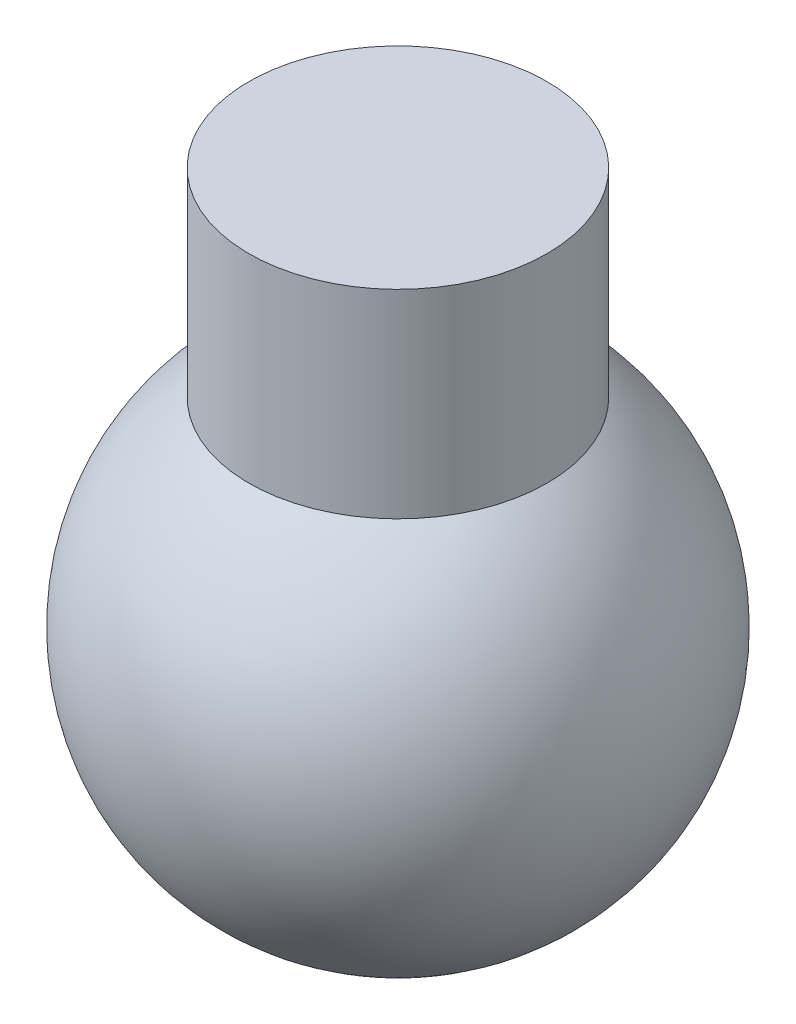
ISO-10303-21;
HEADER;
FILE_DESCRIPTION(('STEP AP214'),'2;1');
FILE_NAME('part.step','',(''),(''),'','','');
FILE_SCHEMA(('AUTOMOTIVE_DESIGN { 1 0 10303 214 1 1 1 1 }'));
ENDSEC;
DATA;
#1=APPLICATION_CONTEXT('core data for automotive mechanical design processes');
#2=APPLICATION_PROTOCOL_DEFINITION('international standard','automotive_design',2000,#1);
#3=PRODUCT_CONTEXT('',#1,'mechanical');
#4=PRODUCT('Part','Part','',(#3));
#5=PRODUCT_RELATED_PRODUCT_CATEGORY('part','',(#4));
#6=PRODUCT_DEFINITION_FORMATION('','',#4);
#7=PRODUCT_DEFINITION_CONTEXT('part definition',#1,'design');
#8=PRODUCT_DEFINITION('design','',#6,#7);
#9=PRODUCT_DEFINITION_SHAPE('','',#8);
#10=(LENGTH_UNIT() NAMED_UNIT(*) SI_UNIT(.MILLI.,.METRE.));
#11=(NAMED_UNIT(*) PLANE_ANGLE_UNIT() SI_UNIT($,.RADIAN.));
#12=(NAMED_UNIT(*) SI_UNIT($,.STERADIAN.) SOLID_ANGLE_UNIT());
#13=UNCERTAINTY_MEASURE_WITH_UNIT(LENGTH_MEASURE(1.E-05),#10,'distance_accuracy_value','');
#14=(GEOMETRIC_REPRESENTATION_CONTEXT(3) GLOBAL_UNCERTAINTY_ASSIGNED_CONTEXT((#13)) GLOBAL_UNIT_ASSIGNED_CONTEXT((#10,
#11,#12)) REPRESENTATION_CONTEXT('',''));
#15=CARTESIAN_POINT('',(0.,0.,0.));
#16=DIRECTION('',(0.,0.,1.));
#17=DIRECTION('',(1.,0.,0.));
#18=AXIS2_PLACEMENT_3D('',#15,#16,#17);
#19=CARTESIAN_POINT('',(0.,-30.,264.));
#20=DIRECTION('',(0.,0.,-1.));
#21=DIRECTION('',(1.,0.,0.));
#22=AXIS2_PLACEMENT_3D('',#19,#20,#21);
#23=SPHERICAL_SURFACE('',#22,2.5);
#24=CARTESIAN_POINT('',(0.,-30.,264.));
#25=DIRECTION('',(0.,-1.,0.));
#26=DIRECTION('',(1.,0.,0.));
#27=AXIS2_PLACEMENT_3D('',#24,#25,#26);
#28=SPHERICAL_SURFACE('',#27,2.5);
#29=CARTESIAN_POINT('',(0.,-28.,264.));
#30=DIRECTION('',(0.,-1.,0.));
#31=DIRECTION('',(1.,0.,0.));
#32=AXIS2_PLACEMENT_3D('',#29,#30,#31);
#33=CIRCLE('',#32,1.5);
#34=CARTESIAN_POINT('',(1.50000000000001,-28.,264.));
#35=VERTEX_POINT('',#34);
#36=EDGE_CURVE('E43',#35,#35,#33,.F.);
#37=ORIENTED_EDGE('',*,*,#36,.F.);
#38=EDGE_LOOP('',(#37));
#39=FACE_BOUND('',#38,.T.);
#40=ADVANCED_FACE('F39',(#39),#28,.T.);
#41=CARTESIAN_POINT('',(0.,-30.,264.));
#42=DIRECTION('',(0.,1.,0.));
#43=DIRECTION('',(-1.,0.,0.));
#44=AXIS2_PLACEMENT_3D('',#41,#42,#43);
#45=CYLINDRICAL_SURFACE('',#44,1.5);
#46=ORIENTED_EDGE('',*,*,#36,.T.);
#47=EDGE_LOOP('',(#46));
#48=FACE_BOUND('',#47,.T.);
#49=CARTESIAN_POINT('',(0.,-26.,264.));
#50=DIRECTION('',(0.,-1.,0.));
#51=DIRECTION('',(1.,0.,0.));
#52=AXIS2_PLACEMENT_3D('',#49,#50,#51);
#53=CIRCLE('',#52,1.5);
#54=CARTESIAN_POINT('',(1.5,-26.,264.));
#55=VERTEX_POINT('',#54);
#56=EDGE_CURVE('E10',#55,#55,#53,.T.);
#57=ORIENTED_EDGE('',*,*,#56,.T.);
#58=EDGE_LOOP('',(#57));
#59=FACE_BOUND('',#58,.T.);
#60=ADVANCED_FACE('F41',(#48,#59),#45,.T.);
#61=CARTESIAN_POINT('',(0.,-26.,264.));
#62=DIRECTION('',(0.,-1.,0.));
#63=DIRECTION('',(1.,0.,0.));
#64=AXIS2_PLACEMENT_3D('',#61,#62,#63);
#65=PLANE('',#64);
#66=ORIENTED_EDGE('',*,*,#56,.F.);
#67=EDGE_LOOP('',(#66));
#68=FACE_BOUND('',#67,.T.);
#69=ADVANCED_FACE('F59',(#68),#65,.F.);
#70=CLOSED_SHELL('',(#40,#60,#69));
#71=MANIFOLD_SOLID_BREP('B2',#70);
#72=ADVANCED_BREP_SHAPE_REPRESENTATION('',(#18,#71),#14);
#73=SHAPE_DEFINITION_REPRESENTATION(#9,#72);
ENDSEC;
END-ISO-10303-21;
